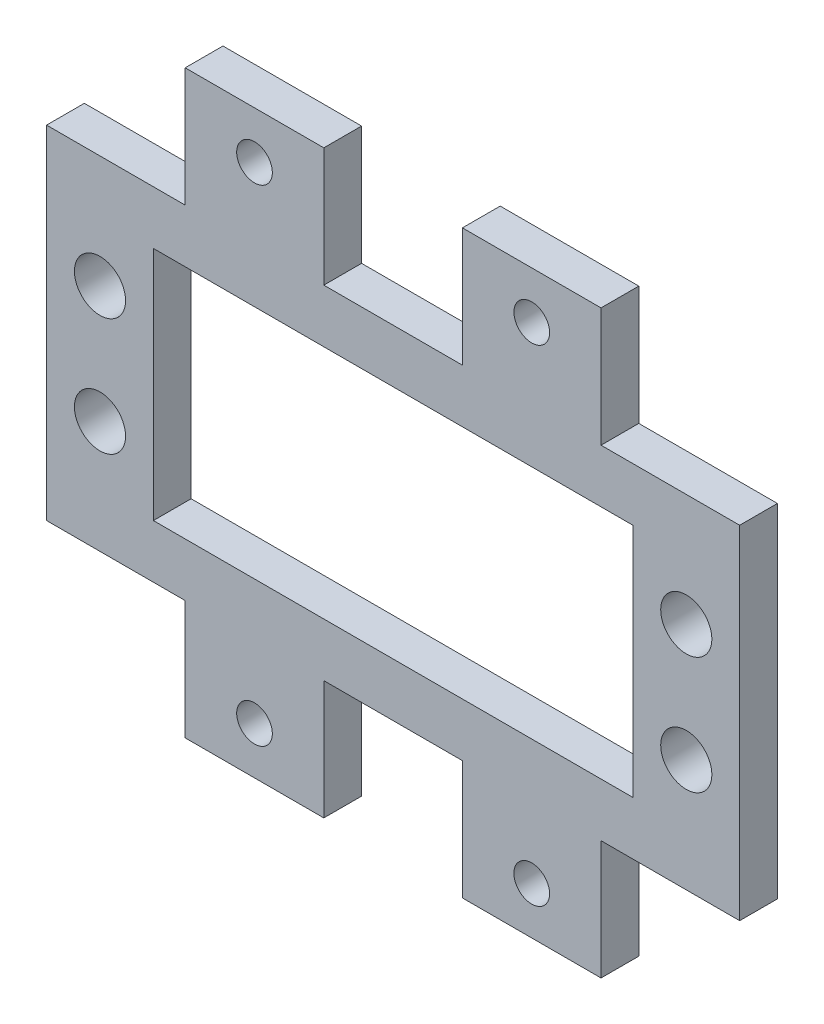
ISO-10303-21;
HEADER;
FILE_DESCRIPTION(('STEP AP214'),'2;1');
FILE_NAME('part.step','',(''),(''),'','','');
FILE_SCHEMA(('AUTOMOTIVE_DESIGN { 1 0 10303 214 1 1 1 1 }'));
ENDSEC;
DATA;
#1=APPLICATION_CONTEXT('core data for automotive mechanical design processes');
#2=APPLICATION_PROTOCOL_DEFINITION('international standard','automotive_design',2000,#1);
#3=PRODUCT_CONTEXT('',#1,'mechanical');
#4=PRODUCT('Part','Part','',(#3));
#5=PRODUCT_RELATED_PRODUCT_CATEGORY('part','',(#4));
#6=PRODUCT_DEFINITION_FORMATION('','',#4);
#7=PRODUCT_DEFINITION_CONTEXT('part definition',#1,'design');
#8=PRODUCT_DEFINITION('design','',#6,#7);
#9=PRODUCT_DEFINITION_SHAPE('','',#8);
#10=(LENGTH_UNIT() NAMED_UNIT(*) SI_UNIT(.MILLI.,.METRE.));
#11=(NAMED_UNIT(*) PLANE_ANGLE_UNIT() SI_UNIT($,.RADIAN.));
#12=(NAMED_UNIT(*) SI_UNIT($,.STERADIAN.) SOLID_ANGLE_UNIT());
#13=UNCERTAINTY_MEASURE_WITH_UNIT(LENGTH_MEASURE(1.E-05),#10,'distance_accuracy_value','');
#14=(GEOMETRIC_REPRESENTATION_CONTEXT(3) GLOBAL_UNCERTAINTY_ASSIGNED_CONTEXT((#13)) GLOBAL_UNIT_ASSIGNED_CONTEXT((#10,
#11,#12)) REPRESENTATION_CONTEXT('',''));
#15=CARTESIAN_POINT('',(0.,0.,0.));
#16=DIRECTION('',(0.,0.,1.));
#17=DIRECTION('',(1.,0.,0.));
#18=AXIS2_PLACEMENT_3D('',#15,#16,#17);
#19=CARTESIAN_POINT('',(0.,0.,3.175));
#20=DIRECTION('',(0.,0.,-1.));
#21=DIRECTION('',(-1.,0.,0.));
#22=AXIS2_PLACEMENT_3D('',#19,#20,#21);
#23=PLANE('',#22);
#24=DIRECTION('',(0.,1.,0.));
#25=VECTOR('',#24,1.);
#26=CARTESIAN_POINT('',(34.968,14.4,3.175));
#27=LINE('',#26,#25);
#28=CARTESIAN_POINT('',(34.968,14.4,3.175));
#29=VERTEX_POINT('',#28);
#30=CARTESIAN_POINT('',(34.968,24.4,3.175));
#31=VERTEX_POINT('',#30);
#32=EDGE_CURVE('E240',#29,#31,#27,.T.);
#33=ORIENTED_EDGE('',*,*,#32,.F.);
#34=DIRECTION('',(-1.,0.,0.));
#35=VECTOR('',#34,1.);
#36=CARTESIAN_POINT('',(23.312,14.4,3.175));
#37=LINE('',#36,#35);
#38=CARTESIAN_POINT('',(23.312,14.4,3.175));
#39=VERTEX_POINT('',#38);
#40=EDGE_CURVE('E234',#29,#39,#37,.T.);
#41=ORIENTED_EDGE('',*,*,#40,.T.);
#42=DIRECTION('',(0.,1.,0.));
#43=VECTOR('',#42,1.);
#44=CARTESIAN_POINT('',(23.312,14.4,3.175));
#45=LINE('',#44,#43);
#46=CARTESIAN_POINT('',(23.312,24.4,3.175));
#47=VERTEX_POINT('',#46);
#48=EDGE_CURVE('E114',#39,#47,#45,.T.);
#49=ORIENTED_EDGE('',*,*,#48,.T.);
#50=DIRECTION('',(-1.,0.,0.));
#51=VECTOR('',#50,1.);
#52=CARTESIAN_POINT('',(11.656,24.4,3.175));
#53=LINE('',#52,#51);
#54=CARTESIAN_POINT('',(11.656,24.4,3.175));
#55=VERTEX_POINT('',#54);
#56=EDGE_CURVE('E108',#47,#55,#53,.T.);
#57=ORIENTED_EDGE('',*,*,#56,.T.);
#58=DIRECTION('',(0.,-1.,0.));
#59=VECTOR('',#58,1.);
#60=CARTESIAN_POINT('',(11.656,14.4,3.175));
#61=LINE('',#60,#59);
#62=CARTESIAN_POINT('',(11.656,14.4,3.175));
#63=VERTEX_POINT('',#62);
#64=EDGE_CURVE('E112',#55,#63,#61,.T.);
#65=ORIENTED_EDGE('',*,*,#64,.T.);
#66=DIRECTION('',(-1.,0.,0.));
#67=VECTOR('',#66,1.);
#68=CARTESIAN_POINT('',(0.,14.4,3.175));
#69=LINE('',#68,#67);
#70=CARTESIAN_POINT('',(0.,14.4,3.175));
#71=VERTEX_POINT('',#70);
#72=EDGE_CURVE('E57',#63,#71,#69,.T.);
#73=ORIENTED_EDGE('',*,*,#72,.T.);
#74=DIRECTION('',(0.,-1.,0.));
#75=VECTOR('',#74,1.);
#76=CARTESIAN_POINT('',(0.,0.,3.175));
#77=LINE('',#76,#75);
#78=CARTESIAN_POINT('',(0.,-14.4,3.175));
#79=VERTEX_POINT('',#78);
#80=EDGE_CURVE('E132',#71,#79,#77,.T.);
#81=ORIENTED_EDGE('',*,*,#80,.T.);
#82=DIRECTION('',(-1.,0.,0.));
#83=VECTOR('',#82,1.);
#84=CARTESIAN_POINT('',(0.,-14.4,3.175));
#85=LINE('',#84,#83);
#86=CARTESIAN_POINT('',(11.656,-14.4,3.175));
#87=VERTEX_POINT('',#86);
#88=EDGE_CURVE('E204',#87,#79,#85,.T.);
#89=ORIENTED_EDGE('',*,*,#88,.F.);
#90=DIRECTION('',(0.,1.,0.));
#91=VECTOR('',#90,1.);
#92=CARTESIAN_POINT('',(11.656,-14.4,3.175));
#93=LINE('',#92,#91);
#94=CARTESIAN_POINT('',(11.656,-24.4,3.175));
#95=VERTEX_POINT('',#94);
#96=EDGE_CURVE('E282',#95,#87,#93,.T.);
#97=ORIENTED_EDGE('',*,*,#96,.F.);
#98=DIRECTION('',(-1.,0.,0.));
#99=VECTOR('',#98,1.);
#100=CARTESIAN_POINT('',(11.656,-24.4,3.175));
#101=LINE('',#100,#99);
#102=CARTESIAN_POINT('',(23.312,-24.4,3.175));
#103=VERTEX_POINT('',#102);
#104=EDGE_CURVE('E287',#103,#95,#101,.T.);
#105=ORIENTED_EDGE('',*,*,#104,.F.);
#106=DIRECTION('',(0.,-1.,0.));
#107=VECTOR('',#106,1.);
#108=CARTESIAN_POINT('',(23.312,-14.4,3.175));
#109=LINE('',#108,#107);
#110=CARTESIAN_POINT('',(23.312,-14.4,3.175));
#111=VERTEX_POINT('',#110);
#112=EDGE_CURVE('E291',#111,#103,#109,.T.);
#113=ORIENTED_EDGE('',*,*,#112,.F.);
#114=DIRECTION('',(-1.,0.,0.));
#115=VECTOR('',#114,1.);
#116=CARTESIAN_POINT('',(23.312,-14.4,3.175));
#117=LINE('',#116,#115);
#118=CARTESIAN_POINT('',(34.968,-14.4,3.175));
#119=VERTEX_POINT('',#118);
#120=EDGE_CURVE('E295',#119,#111,#117,.T.);
#121=ORIENTED_EDGE('',*,*,#120,.F.);
#122=DIRECTION('',(0.,-1.,0.));
#123=VECTOR('',#122,1.);
#124=CARTESIAN_POINT('',(34.968,-14.4,3.175));
#125=LINE('',#124,#123);
#126=CARTESIAN_POINT('',(34.968,-24.4,3.175));
#127=VERTEX_POINT('',#126);
#128=EDGE_CURVE('E547',#119,#127,#125,.T.);
#129=ORIENTED_EDGE('',*,*,#128,.T.);
#130=DIRECTION('',(1.,0.,0.));
#131=VECTOR('',#130,1.);
#132=CARTESIAN_POINT('',(46.624,-24.4,3.175));
#133=LINE('',#132,#131);
#134=CARTESIAN_POINT('',(46.624,-24.4,3.175));
#135=VERTEX_POINT('',#134);
#136=EDGE_CURVE('E565',#127,#135,#133,.T.);
#137=ORIENTED_EDGE('',*,*,#136,.T.);
#138=DIRECTION('',(0.,1.,0.));
#139=VECTOR('',#138,1.);
#140=CARTESIAN_POINT('',(46.624,-14.4,3.175));
#141=LINE('',#140,#139);
#142=CARTESIAN_POINT('',(46.624,-14.4,3.175));
#143=VERTEX_POINT('',#142);
#144=EDGE_CURVE('E452',#135,#143,#141,.T.);
#145=ORIENTED_EDGE('',*,*,#144,.T.);
#146=DIRECTION('',(1.,0.,0.));
#147=VECTOR('',#146,1.);
#148=CARTESIAN_POINT('',(58.28,-14.4,3.175));
#149=LINE('',#148,#147);
#150=CARTESIAN_POINT('',(58.28,-14.4,3.175));
#151=VERTEX_POINT('',#150);
#152=EDGE_CURVE('E435',#143,#151,#149,.T.);
#153=ORIENTED_EDGE('',*,*,#152,.T.);
#154=DIRECTION('',(0.,-1.,0.));
#155=VECTOR('',#154,1.);
#156=CARTESIAN_POINT('',(58.28,0.,3.175));
#157=LINE('',#156,#155);
#158=CARTESIAN_POINT('',(58.28,14.4,3.175));
#159=VERTEX_POINT('',#158);
#160=EDGE_CURVE('E449',#159,#151,#157,.T.);
#161=ORIENTED_EDGE('',*,*,#160,.F.);
#162=DIRECTION('',(1.,0.,0.));
#163=VECTOR('',#162,1.);
#164=CARTESIAN_POINT('',(58.28,14.4,3.175));
#165=LINE('',#164,#163);
#166=CARTESIAN_POINT('',(46.624,14.4,3.175));
#167=VERTEX_POINT('',#166);
#168=EDGE_CURVE('E460',#167,#159,#165,.T.);
#169=ORIENTED_EDGE('',*,*,#168,.F.);
#170=DIRECTION('',(0.,-1.,0.));
#171=VECTOR('',#170,1.);
#172=CARTESIAN_POINT('',(46.624,14.4,3.175));
#173=LINE('',#172,#171);
#174=CARTESIAN_POINT('',(46.624,24.4,3.175));
#175=VERTEX_POINT('',#174);
#176=EDGE_CURVE('E466',#175,#167,#173,.T.);
#177=ORIENTED_EDGE('',*,*,#176,.F.);
#178=DIRECTION('',(1.,0.,0.));
#179=VECTOR('',#178,1.);
#180=CARTESIAN_POINT('',(46.624,24.4,3.175));
#181=LINE('',#180,#179);
#182=EDGE_CURVE('E500',#31,#175,#181,.T.);
#183=ORIENTED_EDGE('',*,*,#182,.F.);
#184=EDGE_LOOP('',(#33,#41,#49,#57,#65,#73,#81,#89,#97,#105,#113,#121,#129,#137,#145,#153,#161,
#169,#177,#183));
#185=FACE_BOUND('',#184,.T.);
#186=DIRECTION('',(1.,0.,0.));
#187=VECTOR('',#186,1.);
#188=CARTESIAN_POINT('',(8.98,9.90999999999999,3.175));
#189=LINE('',#188,#187);
#190=CARTESIAN_POINT('',(8.98,9.90999999999999,3.175));
#191=VERTEX_POINT('',#190);
#192=CARTESIAN_POINT('',(49.3,9.90999999999999,3.175));
#193=VERTEX_POINT('',#192);
#194=EDGE_CURVE('E231',#191,#193,#189,.T.);
#195=ORIENTED_EDGE('',*,*,#194,.T.);
#196=DIRECTION('',(0.,1.,0.));
#197=VECTOR('',#196,1.);
#198=CARTESIAN_POINT('',(49.3,9.90999999999999,3.175));
#199=LINE('',#198,#197);
#200=CARTESIAN_POINT('',(49.3,-9.90999999999999,3.175));
#201=VERTEX_POINT('',#200);
#202=EDGE_CURVE('E491',#201,#193,#199,.T.);
#203=ORIENTED_EDGE('',*,*,#202,.F.);
#204=DIRECTION('',(1.,0.,0.));
#205=VECTOR('',#204,1.);
#206=CARTESIAN_POINT('',(8.98,-9.90999999999999,3.175));
#207=LINE('',#206,#205);
#208=CARTESIAN_POINT('',(8.98,-9.90999999999999,3.175));
#209=VERTEX_POINT('',#208);
#210=EDGE_CURVE('E299',#209,#201,#207,.T.);
#211=ORIENTED_EDGE('',*,*,#210,.F.);
#212=DIRECTION('',(0.,1.,0.));
#213=VECTOR('',#212,1.);
#214=CARTESIAN_POINT('',(8.98,9.90999999999999,3.175));
#215=LINE('',#214,#213);
#216=EDGE_CURVE('E96',#209,#191,#215,.T.);
#217=ORIENTED_EDGE('',*,*,#216,.T.);
#218=EDGE_LOOP('',(#195,#203,#211,#217));
#219=FACE_BOUND('',#218,.T.);
#220=CARTESIAN_POINT('',(17.484,20.43125,3.175));
#221=DIRECTION('',(0.,0.,1.));
#222=DIRECTION('',(1.,0.,0.));
#223=AXIS2_PLACEMENT_3D('',#220,#221,#222);
#224=CIRCLE('',#223,1.5);
#225=CARTESIAN_POINT('',(18.984,20.43125,3.175));
#226=VERTEX_POINT('',#225);
#227=EDGE_CURVE('E143',#226,#226,#224,.T.);
#228=ORIENTED_EDGE('',*,*,#227,.F.);
#229=EDGE_LOOP('',(#228));
#230=FACE_BOUND('',#229,.T.);
#231=CARTESIAN_POINT('',(4.49,4.935,3.175));
#232=DIRECTION('',(0.,0.,1.));
#233=DIRECTION('',(1.,0.,0.));
#234=AXIS2_PLACEMENT_3D('',#231,#232,#233);
#235=CIRCLE('',#234,2.15);
#236=CARTESIAN_POINT('',(6.64,4.935,3.175));
#237=VERTEX_POINT('',#236);
#238=EDGE_CURVE('E212',#237,#237,#235,.T.);
#239=ORIENTED_EDGE('',*,*,#238,.F.);
#240=EDGE_LOOP('',(#239));
#241=FACE_BOUND('',#240,.T.);
#242=CARTESIAN_POINT('',(4.49,-4.935,3.175));
#243=DIRECTION('',(0.,0.,-1.));
#244=DIRECTION('',(1.,0.,0.));
#245=AXIS2_PLACEMENT_3D('',#242,#243,#244);
#246=CIRCLE('',#245,2.15);
#247=CARTESIAN_POINT('',(6.64,-4.935,3.175));
#248=VERTEX_POINT('',#247);
#249=EDGE_CURVE('E265',#248,#248,#246,.T.);
#250=ORIENTED_EDGE('',*,*,#249,.T.);
#251=EDGE_LOOP('',(#250));
#252=FACE_BOUND('',#251,.T.);
#253=CARTESIAN_POINT('',(17.484,-20.43125,3.175));
#254=DIRECTION('',(0.,0.,-1.));
#255=DIRECTION('',(1.,0.,0.));
#256=AXIS2_PLACEMENT_3D('',#253,#254,#255);
#257=CIRCLE('',#256,1.5);
#258=CARTESIAN_POINT('',(18.984,-20.43125,3.175));
#259=VERTEX_POINT('',#258);
#260=EDGE_CURVE('E273',#259,#259,#257,.T.);
#261=ORIENTED_EDGE('',*,*,#260,.T.);
#262=EDGE_LOOP('',(#261));
#263=FACE_BOUND('',#262,.T.);
#264=CARTESIAN_POINT('',(40.796,20.43125,3.175));
#265=DIRECTION('',(0.,0.,-1.));
#266=DIRECTION('',(-1.,0.,0.));
#267=AXIS2_PLACEMENT_3D('',#264,#265,#266);
#268=CIRCLE('',#267,1.5);
#269=CARTESIAN_POINT('',(39.296,20.43125,3.175));
#270=VERTEX_POINT('',#269);
#271=EDGE_CURVE('E474',#270,#270,#268,.T.);
#272=ORIENTED_EDGE('',*,*,#271,.T.);
#273=EDGE_LOOP('',(#272));
#274=FACE_BOUND('',#273,.T.);
#275=CARTESIAN_POINT('',(53.79,4.935,3.175));
#276=DIRECTION('',(0.,0.,-1.));
#277=DIRECTION('',(-1.,0.,0.));
#278=AXIS2_PLACEMENT_3D('',#275,#276,#277);
#279=CIRCLE('',#278,2.15);
#280=CARTESIAN_POINT('',(51.64,4.935,3.175));
#281=VERTEX_POINT('',#280);
#282=EDGE_CURVE('E521',#281,#281,#279,.T.);
#283=ORIENTED_EDGE('',*,*,#282,.T.);
#284=EDGE_LOOP('',(#283));
#285=FACE_BOUND('',#284,.T.);
#286=CARTESIAN_POINT('',(53.79,-4.935,3.175));
#287=DIRECTION('',(0.,0.,1.));
#288=DIRECTION('',(-1.,0.,0.));
#289=AXIS2_PLACEMENT_3D('',#286,#287,#288);
#290=CIRCLE('',#289,2.15);
#291=CARTESIAN_POINT('',(51.64,-4.935,3.175));
#292=VERTEX_POINT('',#291);
#293=EDGE_CURVE('E574',#292,#292,#290,.T.);
#294=ORIENTED_EDGE('',*,*,#293,.F.);
#295=EDGE_LOOP('',(#294));
#296=FACE_BOUND('',#295,.T.);
#297=CARTESIAN_POINT('',(40.796,-20.43125,3.175));
#298=DIRECTION('',(0.,0.,1.));
#299=DIRECTION('',(-1.,0.,0.));
#300=AXIS2_PLACEMENT_3D('',#297,#298,#299);
#301=CIRCLE('',#300,1.5);
#302=CARTESIAN_POINT('',(39.296,-20.43125,3.175));
#303=VERTEX_POINT('',#302);
#304=EDGE_CURVE('E561',#303,#303,#301,.T.);
#305=ORIENTED_EDGE('',*,*,#304,.F.);
#306=EDGE_LOOP('',(#305));
#307=FACE_BOUND('',#306,.T.);
#308=ADVANCED_FACE('F39',(#185,#219,#230,#241,#252,#263,#274,#285,#296,#307),#23,.F.);
#309=CARTESIAN_POINT('',(0.,0.,0.));
#310=DIRECTION('',(0.,0.,-1.));
#311=DIRECTION('',(-1.,0.,0.));
#312=AXIS2_PLACEMENT_3D('',#309,#310,#311);
#313=PLANE('',#312);
#314=DIRECTION('',(-1.,0.,0.));
#315=VECTOR('',#314,1.);
#316=CARTESIAN_POINT('',(23.312,14.4,0.));
#317=LINE('',#316,#315);
#318=CARTESIAN_POINT('',(34.968,14.4,0.));
#319=VERTEX_POINT('',#318);
#320=CARTESIAN_POINT('',(23.312,14.4,0.));
#321=VERTEX_POINT('',#320);
#322=EDGE_CURVE('E147',#319,#321,#317,.T.);
#323=ORIENTED_EDGE('',*,*,#322,.F.);
#324=DIRECTION('',(0.,1.,0.));
#325=VECTOR('',#324,1.);
#326=CARTESIAN_POINT('',(34.968,14.4,0.));
#327=LINE('',#326,#325);
#328=CARTESIAN_POINT('',(34.968,24.4,0.));
#329=VERTEX_POINT('',#328);
#330=EDGE_CURVE('E251',#319,#329,#327,.T.);
#331=ORIENTED_EDGE('',*,*,#330,.T.);
#332=DIRECTION('',(1.,0.,0.));
#333=VECTOR('',#332,1.);
#334=CARTESIAN_POINT('',(46.624,24.4,0.));
#335=LINE('',#334,#333);
#336=CARTESIAN_POINT('',(46.624,24.4,0.));
#337=VERTEX_POINT('',#336);
#338=EDGE_CURVE('E477',#329,#337,#335,.T.);
#339=ORIENTED_EDGE('',*,*,#338,.T.);
#340=DIRECTION('',(0.,-1.,0.));
#341=VECTOR('',#340,1.);
#342=CARTESIAN_POINT('',(46.624,14.4,0.));
#343=LINE('',#342,#341);
#344=CARTESIAN_POINT('',(46.624,14.4,0.));
#345=VERTEX_POINT('',#344);
#346=EDGE_CURVE('E481',#337,#345,#343,.T.);
#347=ORIENTED_EDGE('',*,*,#346,.T.);
#348=DIRECTION('',(1.,0.,0.));
#349=VECTOR('',#348,1.);
#350=CARTESIAN_POINT('',(58.28,14.4,0.));
#351=LINE('',#350,#349);
#352=CARTESIAN_POINT('',(58.28,14.4,0.));
#353=VERTEX_POINT('',#352);
#354=EDGE_CURVE('E485',#345,#353,#351,.T.);
#355=ORIENTED_EDGE('',*,*,#354,.T.);
#356=DIRECTION('',(0.,-1.,0.));
#357=VECTOR('',#356,1.);
#358=CARTESIAN_POINT('',(58.28,0.,0.));
#359=LINE('',#358,#357);
#360=CARTESIAN_POINT('',(58.28,-14.4,0.));
#361=VERTEX_POINT('',#360);
#362=EDGE_CURVE('E489',#353,#361,#359,.T.);
#363=ORIENTED_EDGE('',*,*,#362,.T.);
#364=DIRECTION('',(1.,0.,0.));
#365=VECTOR('',#364,1.);
#366=CARTESIAN_POINT('',(58.28,-14.4,0.));
#367=LINE('',#366,#365);
#368=CARTESIAN_POINT('',(46.624,-14.4,0.));
#369=VERTEX_POINT('',#368);
#370=EDGE_CURVE('E438',#369,#361,#367,.T.);
#371=ORIENTED_EDGE('',*,*,#370,.F.);
#372=DIRECTION('',(0.,1.,0.));
#373=VECTOR('',#372,1.);
#374=CARTESIAN_POINT('',(46.624,-14.4,0.));
#375=LINE('',#374,#373);
#376=CARTESIAN_POINT('',(46.624,-24.4,0.));
#377=VERTEX_POINT('',#376);
#378=EDGE_CURVE('E555',#377,#369,#375,.T.);
#379=ORIENTED_EDGE('',*,*,#378,.F.);
#380=DIRECTION('',(1.,0.,0.));
#381=VECTOR('',#380,1.);
#382=CARTESIAN_POINT('',(46.624,-24.4,0.));
#383=LINE('',#382,#381);
#384=CARTESIAN_POINT('',(34.968,-24.4,0.));
#385=VERTEX_POINT('',#384);
#386=EDGE_CURVE('E551',#385,#377,#383,.T.);
#387=ORIENTED_EDGE('',*,*,#386,.F.);
#388=DIRECTION('',(0.,-1.,0.));
#389=VECTOR('',#388,1.);
#390=CARTESIAN_POINT('',(34.968,-14.4,0.));
#391=LINE('',#390,#389);
#392=CARTESIAN_POINT('',(34.968,-14.4,0.));
#393=VERTEX_POINT('',#392);
#394=EDGE_CURVE('E454',#393,#385,#391,.T.);
#395=ORIENTED_EDGE('',*,*,#394,.F.);
#396=DIRECTION('',(-1.,0.,0.));
#397=VECTOR('',#396,1.);
#398=CARTESIAN_POINT('',(23.312,-14.4,0.));
#399=LINE('',#398,#397);
#400=CARTESIAN_POINT('',(23.312,-14.4,0.));
#401=VERTEX_POINT('',#400);
#402=EDGE_CURVE('E317',#393,#401,#399,.T.);
#403=ORIENTED_EDGE('',*,*,#402,.T.);
#404=DIRECTION('',(0.,-1.,0.));
#405=VECTOR('',#404,1.);
#406=CARTESIAN_POINT('',(23.312,-14.4,0.));
#407=LINE('',#406,#405);
#408=CARTESIAN_POINT('',(23.312,-24.4,0.));
#409=VERTEX_POINT('',#408);
#410=EDGE_CURVE('E313',#401,#409,#407,.T.);
#411=ORIENTED_EDGE('',*,*,#410,.T.);
#412=DIRECTION('',(-1.,0.,0.));
#413=VECTOR('',#412,1.);
#414=CARTESIAN_POINT('',(11.656,-24.4,0.));
#415=LINE('',#414,#413);
#416=CARTESIAN_POINT('',(11.656,-24.4,0.));
#417=VERTEX_POINT('',#416);
#418=EDGE_CURVE('E309',#409,#417,#415,.T.);
#419=ORIENTED_EDGE('',*,*,#418,.T.);
#420=DIRECTION('',(0.,1.,0.));
#421=VECTOR('',#420,1.);
#422=CARTESIAN_POINT('',(11.656,-14.4,0.));
#423=LINE('',#422,#421);
#424=CARTESIAN_POINT('',(11.656,-14.4,0.));
#425=VERTEX_POINT('',#424);
#426=EDGE_CURVE('E306',#417,#425,#423,.T.);
#427=ORIENTED_EDGE('',*,*,#426,.T.);
#428=DIRECTION('',(-1.,0.,0.));
#429=VECTOR('',#428,1.);
#430=CARTESIAN_POINT('',(0.,-14.4,0.));
#431=LINE('',#430,#429);
#432=CARTESIAN_POINT('',(0.,-14.4,0.));
#433=VERTEX_POINT('',#432);
#434=EDGE_CURVE('E188',#425,#433,#431,.T.);
#435=ORIENTED_EDGE('',*,*,#434,.T.);
#436=DIRECTION('',(0.,-1.,0.));
#437=VECTOR('',#436,1.);
#438=CARTESIAN_POINT('',(0.,0.,0.));
#439=LINE('',#438,#437);
#440=CARTESIAN_POINT('',(0.,14.4,0.));
#441=VERTEX_POINT('',#440);
#442=EDGE_CURVE('E159',#441,#433,#439,.T.);
#443=ORIENTED_EDGE('',*,*,#442,.F.);
#444=DIRECTION('',(-1.,0.,0.));
#445=VECTOR('',#444,1.);
#446=CARTESIAN_POINT('',(0.,14.4,0.));
#447=LINE('',#446,#445);
#448=CARTESIAN_POINT('',(11.656,14.4,0.));
#449=VERTEX_POINT('',#448);
#450=EDGE_CURVE('E87',#449,#441,#447,.T.);
#451=ORIENTED_EDGE('',*,*,#450,.F.);
#452=DIRECTION('',(0.,-1.,0.));
#453=VECTOR('',#452,1.);
#454=CARTESIAN_POINT('',(11.656,14.4,0.));
#455=LINE('',#454,#453);
#456=CARTESIAN_POINT('',(11.656,24.4,0.));
#457=VERTEX_POINT('',#456);
#458=EDGE_CURVE('E81',#457,#449,#455,.T.);
#459=ORIENTED_EDGE('',*,*,#458,.F.);
#460=DIRECTION('',(-1.,0.,0.));
#461=VECTOR('',#460,1.);
#462=CARTESIAN_POINT('',(11.656,24.4,0.));
#463=LINE('',#462,#461);
#464=CARTESIAN_POINT('',(23.312,24.4,0.));
#465=VERTEX_POINT('',#464);
#466=EDGE_CURVE('E123',#465,#457,#463,.T.);
#467=ORIENTED_EDGE('',*,*,#466,.F.);
#468=DIRECTION('',(0.,1.,0.));
#469=VECTOR('',#468,1.);
#470=CARTESIAN_POINT('',(23.312,14.4,0.));
#471=LINE('',#470,#469);
#472=EDGE_CURVE('E150',#321,#465,#471,.T.);
#473=ORIENTED_EDGE('',*,*,#472,.F.);
#474=EDGE_LOOP('',(#323,#331,#339,#347,#355,#363,#371,#379,#387,#395,#403,#411,#419,#427,#435,
#443,#451,#459,#467,#473));
#475=FACE_BOUND('',#474,.T.);
#476=CARTESIAN_POINT('',(17.484,20.43125,0.));
#477=DIRECTION('',(0.,0.,1.));
#478=DIRECTION('',(1.,0.,0.));
#479=AXIS2_PLACEMENT_3D('',#476,#477,#478);
#480=CIRCLE('',#479,1.5);
#481=CARTESIAN_POINT('',(18.984,20.43125,0.));
#482=VERTEX_POINT('',#481);
#483=EDGE_CURVE('E221',#482,#482,#480,.T.);
#484=ORIENTED_EDGE('',*,*,#483,.T.);
#485=EDGE_LOOP('',(#484));
#486=FACE_BOUND('',#485,.T.);
#487=DIRECTION('',(0.,1.,0.));
#488=VECTOR('',#487,1.);
#489=CARTESIAN_POINT('',(8.98,9.90999999999999,0.));
#490=LINE('',#489,#488);
#491=CARTESIAN_POINT('',(8.98,-9.90999999999999,0.));
#492=VERTEX_POINT('',#491);
#493=CARTESIAN_POINT('',(8.98,9.90999999999999,0.));
#494=VERTEX_POINT('',#493);
#495=EDGE_CURVE('E139',#492,#494,#490,.T.);
#496=ORIENTED_EDGE('',*,*,#495,.F.);
#497=DIRECTION('',(1.,0.,0.));
#498=VECTOR('',#497,1.);
#499=CARTESIAN_POINT('',(8.98,-9.90999999999999,0.));
#500=LINE('',#499,#498);
#501=CARTESIAN_POINT('',(49.3,-9.90999999999999,0.));
#502=VERTEX_POINT('',#501);
#503=EDGE_CURVE('E283',#492,#502,#500,.T.);
#504=ORIENTED_EDGE('',*,*,#503,.T.);
#505=DIRECTION('',(0.,1.,0.));
#506=VECTOR('',#505,1.);
#507=CARTESIAN_POINT('',(49.3,9.90999999999999,0.));
#508=LINE('',#507,#506);
#509=CARTESIAN_POINT('',(49.3,9.90999999999999,0.));
#510=VERTEX_POINT('',#509);
#511=EDGE_CURVE('E470',#502,#510,#508,.T.);
#512=ORIENTED_EDGE('',*,*,#511,.T.);
#513=DIRECTION('',(1.,0.,0.));
#514=VECTOR('',#513,1.);
#515=CARTESIAN_POINT('',(8.98,9.90999999999999,0.));
#516=LINE('',#515,#514);
#517=EDGE_CURVE('E142',#494,#510,#516,.T.);
#518=ORIENTED_EDGE('',*,*,#517,.F.);
#519=EDGE_LOOP('',(#496,#504,#512,#518));
#520=FACE_BOUND('',#519,.T.);
#521=CARTESIAN_POINT('',(4.49,4.935,0.));
#522=DIRECTION('',(0.,0.,1.));
#523=DIRECTION('',(1.,0.,0.));
#524=AXIS2_PLACEMENT_3D('',#521,#522,#523);
#525=CIRCLE('',#524,2.15);
#526=CARTESIAN_POINT('',(6.64,4.935,0.));
#527=VERTEX_POINT('',#526);
#528=EDGE_CURVE('E206',#527,#527,#525,.T.);
#529=ORIENTED_EDGE('',*,*,#528,.T.);
#530=EDGE_LOOP('',(#529));
#531=FACE_BOUND('',#530,.T.);
#532=CARTESIAN_POINT('',(4.49,-4.935,0.));
#533=DIRECTION('',(0.,0.,-1.));
#534=DIRECTION('',(1.,0.,0.));
#535=AXIS2_PLACEMENT_3D('',#532,#533,#534);
#536=CIRCLE('',#535,2.15);
#537=CARTESIAN_POINT('',(6.64,-4.935,0.));
#538=VERTEX_POINT('',#537);
#539=EDGE_CURVE('E259',#538,#538,#536,.T.);
#540=ORIENTED_EDGE('',*,*,#539,.F.);
#541=EDGE_LOOP('',(#540));
#542=FACE_BOUND('',#541,.T.);
#543=CARTESIAN_POINT('',(17.484,-20.43125,0.));
#544=DIRECTION('',(0.,0.,-1.));
#545=DIRECTION('',(1.,0.,0.));
#546=AXIS2_PLACEMENT_3D('',#543,#544,#545);
#547=CIRCLE('',#546,1.5);
#548=CARTESIAN_POINT('',(18.984,-20.43125,0.));
#549=VERTEX_POINT('',#548);
#550=EDGE_CURVE('E269',#549,#549,#547,.T.);
#551=ORIENTED_EDGE('',*,*,#550,.F.);
#552=EDGE_LOOP('',(#551));
#553=FACE_BOUND('',#552,.T.);
#554=CARTESIAN_POINT('',(40.796,20.43125,0.));
#555=DIRECTION('',(0.,0.,-1.));
#556=DIRECTION('',(-1.,0.,0.));
#557=AXIS2_PLACEMENT_3D('',#554,#555,#556);
#558=CIRCLE('',#557,1.5);
#559=CARTESIAN_POINT('',(39.296,20.43125,0.));
#560=VERTEX_POINT('',#559);
#561=EDGE_CURVE('E517',#560,#560,#558,.T.);
#562=ORIENTED_EDGE('',*,*,#561,.F.);
#563=EDGE_LOOP('',(#562));
#564=FACE_BOUND('',#563,.T.);
#565=CARTESIAN_POINT('',(53.79,4.935,0.));
#566=DIRECTION('',(0.,0.,-1.));
#567=DIRECTION('',(-1.,0.,0.));
#568=AXIS2_PLACEMENT_3D('',#565,#566,#567);
#569=CIRCLE('',#568,2.15);
#570=CARTESIAN_POINT('',(51.64,4.935,0.));
#571=VERTEX_POINT('',#570);
#572=EDGE_CURVE('E444',#571,#571,#569,.T.);
#573=ORIENTED_EDGE('',*,*,#572,.F.);
#574=EDGE_LOOP('',(#573));
#575=FACE_BOUND('',#574,.T.);
#576=CARTESIAN_POINT('',(53.79,-4.935,0.));
#577=DIRECTION('',(0.,0.,1.));
#578=DIRECTION('',(-1.,0.,0.));
#579=AXIS2_PLACEMENT_3D('',#576,#577,#578);
#580=CIRCLE('',#579,2.15);
#581=CARTESIAN_POINT('',(51.64,-4.935,0.));
#582=VERTEX_POINT('',#581);
#583=EDGE_CURVE('E578',#582,#582,#580,.T.);
#584=ORIENTED_EDGE('',*,*,#583,.T.);
#585=EDGE_LOOP('',(#584));
#586=FACE_BOUND('',#585,.T.);
#587=CARTESIAN_POINT('',(40.796,-20.43125,0.));
#588=DIRECTION('',(0.,0.,1.));
#589=DIRECTION('',(-1.,0.,0.));
#590=AXIS2_PLACEMENT_3D('',#587,#588,#589);
#591=CIRCLE('',#590,1.5);
#592=CARTESIAN_POINT('',(39.296,-20.43125,0.));
#593=VERTEX_POINT('',#592);
#594=EDGE_CURVE('E570',#593,#593,#591,.T.);
#595=ORIENTED_EDGE('',*,*,#594,.T.);
#596=EDGE_LOOP('',(#595));
#597=FACE_BOUND('',#596,.T.);
#598=ADVANCED_FACE('F178',(#475,#486,#520,#531,#542,#553,#564,#575,#586,#597),#313,.T.);
#599=CARTESIAN_POINT('',(8.98,9.90999999999999,3.175));
#600=DIRECTION('',(-1.,0.,0.));
#601=DIRECTION('',(0.,0.,1.));
#602=AXIS2_PLACEMENT_3D('',#599,#600,#601);
#603=PLANE('',#602);
#604=ORIENTED_EDGE('',*,*,#495,.T.);
#605=DIRECTION('',(0.,0.,-1.));
#606=VECTOR('',#605,1.);
#607=CARTESIAN_POINT('',(8.98,9.90999999999999,3.175));
#608=LINE('',#607,#606);
#609=EDGE_CURVE('E11',#191,#494,#608,.T.);
#610=ORIENTED_EDGE('',*,*,#609,.F.);
#611=ORIENTED_EDGE('',*,*,#216,.F.);
#612=DIRECTION('',(0.,0.,-1.));
#613=VECTOR('',#612,1.);
#614=CARTESIAN_POINT('',(8.98,-9.90999999999999,3.175));
#615=LINE('',#614,#613);
#616=EDGE_CURVE('E303',#209,#492,#615,.T.);
#617=ORIENTED_EDGE('',*,*,#616,.T.);
#618=EDGE_LOOP('',(#604,#610,#611,#617));
#619=FACE_BOUND('',#618,.T.);
#620=ADVANCED_FACE('F41',(#619),#603,.F.);
#621=CARTESIAN_POINT('',(8.98,9.90999999999999,3.175));
#622=DIRECTION('',(0.,1.,0.));
#623=DIRECTION('',(-1.,0.,0.));
#624=AXIS2_PLACEMENT_3D('',#621,#622,#623);
#625=PLANE('',#624);
#626=ORIENTED_EDGE('',*,*,#517,.T.);
#627=DIRECTION('',(0.,0.,-1.));
#628=VECTOR('',#627,1.);
#629=CARTESIAN_POINT('',(49.3,9.90999999999999,3.175));
#630=LINE('',#629,#628);
#631=EDGE_CURVE('E253',#193,#510,#630,.T.);
#632=ORIENTED_EDGE('',*,*,#631,.F.);
#633=ORIENTED_EDGE('',*,*,#194,.F.);
#634=ORIENTED_EDGE('',*,*,#609,.T.);
#635=EDGE_LOOP('',(#626,#632,#633,#634));
#636=FACE_BOUND('',#635,.T.);
#637=ADVANCED_FACE('F606',(#636),#625,.F.);
#638=CARTESIAN_POINT('',(23.312,14.4,3.175));
#639=DIRECTION('',(0.,-1.,0.));
#640=DIRECTION('',(0.,0.,-1.));
#641=AXIS2_PLACEMENT_3D('',#638,#639,#640);
#642=PLANE('',#641);
#643=ORIENTED_EDGE('',*,*,#322,.T.);
#644=DIRECTION('',(0.,0.,-1.));
#645=VECTOR('',#644,1.);
#646=CARTESIAN_POINT('',(23.312,14.4,3.175));
#647=LINE('',#646,#645);
#648=EDGE_CURVE('E49',#39,#321,#647,.T.);
#649=ORIENTED_EDGE('',*,*,#648,.F.);
#650=ORIENTED_EDGE('',*,*,#40,.F.);
#651=DIRECTION('',(0.,0.,-1.));
#652=VECTOR('',#651,1.);
#653=CARTESIAN_POINT('',(34.968,14.4,3.175));
#654=LINE('',#653,#652);
#655=EDGE_CURVE('E243',#29,#319,#654,.T.);
#656=ORIENTED_EDGE('',*,*,#655,.T.);
#657=EDGE_LOOP('',(#643,#649,#650,#656));
#658=FACE_BOUND('',#657,.T.);
#659=ADVANCED_FACE('F242',(#658),#642,.F.);
#660=CARTESIAN_POINT('',(23.312,14.4,3.175));
#661=DIRECTION('',(-1.,0.,0.));
#662=DIRECTION('',(0.,0.,1.));
#663=AXIS2_PLACEMENT_3D('',#660,#661,#662);
#664=PLANE('',#663);
#665=ORIENTED_EDGE('',*,*,#472,.T.);
#666=DIRECTION('',(0.,0.,-1.));
#667=VECTOR('',#666,1.);
#668=CARTESIAN_POINT('',(23.312,24.4,3.175));
#669=LINE('',#668,#667);
#670=EDGE_CURVE('E125',#47,#465,#669,.T.);
#671=ORIENTED_EDGE('',*,*,#670,.F.);
#672=ORIENTED_EDGE('',*,*,#48,.F.);
#673=ORIENTED_EDGE('',*,*,#648,.T.);
#674=EDGE_LOOP('',(#665,#671,#672,#673));
#675=FACE_BOUND('',#674,.T.);
#676=ADVANCED_FACE('F173',(#675),#664,.F.);
#677=CARTESIAN_POINT('',(11.656,24.4,3.175));
#678=DIRECTION('',(0.,-1.,0.));
#679=DIRECTION('',(0.,0.,-1.));
#680=AXIS2_PLACEMENT_3D('',#677,#678,#679);
#681=PLANE('',#680);
#682=ORIENTED_EDGE('',*,*,#466,.T.);
#683=DIRECTION('',(0.,0.,-1.));
#684=VECTOR('',#683,1.);
#685=CARTESIAN_POINT('',(11.656,24.4,3.175));
#686=LINE('',#685,#684);
#687=EDGE_CURVE('E120',#55,#457,#686,.T.);
#688=ORIENTED_EDGE('',*,*,#687,.F.);
#689=ORIENTED_EDGE('',*,*,#56,.F.);
#690=ORIENTED_EDGE('',*,*,#670,.T.);
#691=EDGE_LOOP('',(#682,#688,#689,#690));
#692=FACE_BOUND('',#691,.T.);
#693=ADVANCED_FACE('F121',(#692),#681,.F.);
#694=CARTESIAN_POINT('',(11.656,14.4,3.175));
#695=DIRECTION('',(1.,0.,0.));
#696=DIRECTION('',(0.,0.,-1.));
#697=AXIS2_PLACEMENT_3D('',#694,#695,#696);
#698=PLANE('',#697);
#699=ORIENTED_EDGE('',*,*,#458,.T.);
#700=DIRECTION('',(0.,0.,-1.));
#701=VECTOR('',#700,1.);
#702=CARTESIAN_POINT('',(11.656,14.4,3.175));
#703=LINE('',#702,#701);
#704=EDGE_CURVE('E126',#63,#449,#703,.T.);
#705=ORIENTED_EDGE('',*,*,#704,.F.);
#706=ORIENTED_EDGE('',*,*,#64,.F.);
#707=ORIENTED_EDGE('',*,*,#687,.T.);
#708=EDGE_LOOP('',(#699,#705,#706,#707));
#709=FACE_BOUND('',#708,.T.);
#710=ADVANCED_FACE('F128',(#709),#698,.F.);
#711=CARTESIAN_POINT('',(0.,14.4,3.175));
#712=DIRECTION('',(0.,-1.,0.));
#713=DIRECTION('',(1.,0.,0.));
#714=AXIS2_PLACEMENT_3D('',#711,#712,#713);
#715=PLANE('',#714);
#716=ORIENTED_EDGE('',*,*,#450,.T.);
#717=DIRECTION('',(0.,0.,-1.));
#718=VECTOR('',#717,1.);
#719=CARTESIAN_POINT('',(0.,14.4,3.175));
#720=LINE('',#719,#718);
#721=EDGE_CURVE('E138',#71,#441,#720,.T.);
#722=ORIENTED_EDGE('',*,*,#721,.F.);
#723=ORIENTED_EDGE('',*,*,#72,.F.);
#724=ORIENTED_EDGE('',*,*,#704,.T.);
#725=EDGE_LOOP('',(#716,#722,#723,#724));
#726=FACE_BOUND('',#725,.T.);
#727=ADVANCED_FACE('F613',(#726),#715,.F.);
#728=CARTESIAN_POINT('',(0.,0.,3.175));
#729=DIRECTION('',(1.,0.,0.));
#730=DIRECTION('',(0.,0.,-1.));
#731=AXIS2_PLACEMENT_3D('',#728,#729,#730);
#732=PLANE('',#731);
#733=ORIENTED_EDGE('',*,*,#442,.T.);
#734=DIRECTION('',(0.,0.,-1.));
#735=VECTOR('',#734,1.);
#736=CARTESIAN_POINT('',(0.,-14.4,3.175));
#737=LINE('',#736,#735);
#738=EDGE_CURVE('E195',#79,#433,#737,.T.);
#739=ORIENTED_EDGE('',*,*,#738,.F.);
#740=ORIENTED_EDGE('',*,*,#80,.F.);
#741=ORIENTED_EDGE('',*,*,#721,.T.);
#742=EDGE_LOOP('',(#733,#739,#740,#741));
#743=FACE_BOUND('',#742,.T.);
#744=ADVANCED_FACE('F192',(#743),#732,.F.);
#745=CARTESIAN_POINT('',(17.484,20.43125,3.175));
#746=DIRECTION('',(0.,0.,-1.));
#747=DIRECTION('',(-1.,0.,0.));
#748=AXIS2_PLACEMENT_3D('',#745,#746,#747);
#749=CYLINDRICAL_SURFACE('',#748,1.5);
#750=ORIENTED_EDGE('',*,*,#227,.T.);
#751=EDGE_LOOP('',(#750));
#752=FACE_BOUND('',#751,.T.);
#753=ORIENTED_EDGE('',*,*,#483,.F.);
#754=EDGE_LOOP('',(#753));
#755=FACE_BOUND('',#754,.T.);
#756=ADVANCED_FACE('F612',(#752,#755),#749,.F.);
#757=CARTESIAN_POINT('',(4.49,4.935,3.175));
#758=DIRECTION('',(0.,0.,-1.));
#759=DIRECTION('',(-1.,0.,0.));
#760=AXIS2_PLACEMENT_3D('',#757,#758,#759);
#761=CYLINDRICAL_SURFACE('',#760,2.15);
#762=ORIENTED_EDGE('',*,*,#238,.T.);
#763=EDGE_LOOP('',(#762));
#764=FACE_BOUND('',#763,.T.);
#765=ORIENTED_EDGE('',*,*,#528,.F.);
#766=EDGE_LOOP('',(#765));
#767=FACE_BOUND('',#766,.T.);
#768=ADVANCED_FACE('F717',(#764,#767),#761,.F.);
#769=CARTESIAN_POINT('',(0.,-14.4,3.175));
#770=DIRECTION('',(0.,-1.,0.));
#771=DIRECTION('',(1.,0.,0.));
#772=AXIS2_PLACEMENT_3D('',#769,#770,#771);
#773=PLANE('',#772);
#774=ORIENTED_EDGE('',*,*,#434,.F.);
#775=DIRECTION('',(0.,0.,-1.));
#776=VECTOR('',#775,1.);
#777=CARTESIAN_POINT('',(11.656,-14.4,3.175));
#778=LINE('',#777,#776);
#779=EDGE_CURVE('E207',#87,#425,#778,.T.);
#780=ORIENTED_EDGE('',*,*,#779,.F.);
#781=ORIENTED_EDGE('',*,*,#88,.T.);
#782=ORIENTED_EDGE('',*,*,#738,.T.);
#783=EDGE_LOOP('',(#774,#780,#781,#782));
#784=FACE_BOUND('',#783,.T.);
#785=ADVANCED_FACE('F201',(#784),#773,.T.);
#786=CARTESIAN_POINT('',(11.656,-14.4,3.175));
#787=DIRECTION('',(-1.,0.,0.));
#788=DIRECTION('',(0.,0.,1.));
#789=AXIS2_PLACEMENT_3D('',#786,#787,#788);
#790=PLANE('',#789);
#791=ORIENTED_EDGE('',*,*,#426,.F.);
#792=DIRECTION('',(0.,0.,-1.));
#793=VECTOR('',#792,1.);
#794=CARTESIAN_POINT('',(11.656,-24.4,3.175));
#795=LINE('',#794,#793);
#796=EDGE_CURVE('E215',#95,#417,#795,.T.);
#797=ORIENTED_EDGE('',*,*,#796,.F.);
#798=ORIENTED_EDGE('',*,*,#96,.T.);
#799=ORIENTED_EDGE('',*,*,#779,.T.);
#800=EDGE_LOOP('',(#791,#797,#798,#799));
#801=FACE_BOUND('',#800,.T.);
#802=ADVANCED_FACE('F349',(#801),#790,.T.);
#803=CARTESIAN_POINT('',(11.656,-24.4,3.175));
#804=DIRECTION('',(0.,-1.,0.));
#805=DIRECTION('',(0.,0.,-1.));
#806=AXIS2_PLACEMENT_3D('',#803,#804,#805);
#807=PLANE('',#806);
#808=ORIENTED_EDGE('',*,*,#418,.F.);
#809=DIRECTION('',(0.,0.,-1.));
#810=VECTOR('',#809,1.);
#811=CARTESIAN_POINT('',(23.312,-24.4,3.175));
#812=LINE('',#811,#810);
#813=EDGE_CURVE('E331',#103,#409,#812,.T.);
#814=ORIENTED_EDGE('',*,*,#813,.F.);
#815=ORIENTED_EDGE('',*,*,#104,.T.);
#816=ORIENTED_EDGE('',*,*,#796,.T.);
#817=EDGE_LOOP('',(#808,#814,#815,#816));
#818=FACE_BOUND('',#817,.T.);
#819=ADVANCED_FACE('F341',(#818),#807,.T.);
#820=CARTESIAN_POINT('',(23.312,-14.4,3.175));
#821=DIRECTION('',(1.,0.,0.));
#822=DIRECTION('',(0.,0.,-1.));
#823=AXIS2_PLACEMENT_3D('',#820,#821,#822);
#824=PLANE('',#823);
#825=ORIENTED_EDGE('',*,*,#410,.F.);
#826=DIRECTION('',(0.,0.,-1.));
#827=VECTOR('',#826,1.);
#828=CARTESIAN_POINT('',(23.312,-14.4,3.175));
#829=LINE('',#828,#827);
#830=EDGE_CURVE('E327',#111,#401,#829,.T.);
#831=ORIENTED_EDGE('',*,*,#830,.F.);
#832=ORIENTED_EDGE('',*,*,#112,.T.);
#833=ORIENTED_EDGE('',*,*,#813,.T.);
#834=EDGE_LOOP('',(#825,#831,#832,#833));
#835=FACE_BOUND('',#834,.T.);
#836=ADVANCED_FACE('F357',(#835),#824,.T.);
#837=CARTESIAN_POINT('',(23.312,-14.4,3.175));
#838=DIRECTION('',(0.,-1.,0.));
#839=DIRECTION('',(0.,0.,-1.));
#840=AXIS2_PLACEMENT_3D('',#837,#838,#839);
#841=PLANE('',#840);
#842=ORIENTED_EDGE('',*,*,#402,.F.);
#843=DIRECTION('',(0.,0.,-1.));
#844=VECTOR('',#843,1.);
#845=CARTESIAN_POINT('',(34.968,-14.4,3.175));
#846=LINE('',#845,#844);
#847=EDGE_CURVE('E539',#119,#393,#846,.T.);
#848=ORIENTED_EDGE('',*,*,#847,.F.);
#849=ORIENTED_EDGE('',*,*,#120,.T.);
#850=ORIENTED_EDGE('',*,*,#830,.T.);
#851=EDGE_LOOP('',(#842,#848,#849,#850));
#852=FACE_BOUND('',#851,.T.);
#853=ADVANCED_FACE('F706',(#852),#841,.T.);
#854=CARTESIAN_POINT('',(8.98,-9.90999999999999,3.175));
#855=DIRECTION('',(0.,1.,0.));
#856=DIRECTION('',(-1.,0.,0.));
#857=AXIS2_PLACEMENT_3D('',#854,#855,#856);
#858=PLANE('',#857);
#859=ORIENTED_EDGE('',*,*,#503,.F.);
#860=ORIENTED_EDGE('',*,*,#616,.F.);
#861=ORIENTED_EDGE('',*,*,#210,.T.);
#862=DIRECTION('',(0.,0.,-1.));
#863=VECTOR('',#862,1.);
#864=CARTESIAN_POINT('',(49.3,-9.90999999999999,3.175));
#865=LINE('',#864,#863);
#866=EDGE_CURVE('E543',#201,#502,#865,.T.);
#867=ORIENTED_EDGE('',*,*,#866,.T.);
#868=EDGE_LOOP('',(#859,#860,#861,#867));
#869=FACE_BOUND('',#868,.T.);
#870=ADVANCED_FACE('F640',(#869),#858,.T.);
#871=CARTESIAN_POINT('',(17.484,-20.43125,3.175));
#872=DIRECTION('',(0.,0.,-1.));
#873=DIRECTION('',(-1.,0.,0.));
#874=AXIS2_PLACEMENT_3D('',#871,#872,#873);
#875=CYLINDRICAL_SURFACE('',#874,1.5);
#876=ORIENTED_EDGE('',*,*,#260,.F.);
#877=EDGE_LOOP('',(#876));
#878=FACE_BOUND('',#877,.T.);
#879=ORIENTED_EDGE('',*,*,#550,.T.);
#880=EDGE_LOOP('',(#879));
#881=FACE_BOUND('',#880,.T.);
#882=ADVANCED_FACE('F699',(#878,#881),#875,.F.);
#883=CARTESIAN_POINT('',(4.49,-4.935,3.175));
#884=DIRECTION('',(0.,0.,-1.));
#885=DIRECTION('',(-1.,0.,0.));
#886=AXIS2_PLACEMENT_3D('',#883,#884,#885);
#887=CYLINDRICAL_SURFACE('',#886,2.15);
#888=ORIENTED_EDGE('',*,*,#249,.F.);
#889=EDGE_LOOP('',(#888));
#890=FACE_BOUND('',#889,.T.);
#891=ORIENTED_EDGE('',*,*,#539,.T.);
#892=EDGE_LOOP('',(#891));
#893=FACE_BOUND('',#892,.T.);
#894=ADVANCED_FACE('F696',(#890,#893),#887,.F.);
#895=CARTESIAN_POINT('',(49.3,9.90999999999999,3.175));
#896=DIRECTION('',(1.,0.,0.));
#897=DIRECTION('',(0.,0.,1.));
#898=AXIS2_PLACEMENT_3D('',#895,#896,#897);
#899=PLANE('',#898);
#900=ORIENTED_EDGE('',*,*,#511,.F.);
#901=ORIENTED_EDGE('',*,*,#866,.F.);
#902=ORIENTED_EDGE('',*,*,#202,.T.);
#903=ORIENTED_EDGE('',*,*,#631,.T.);
#904=EDGE_LOOP('',(#900,#901,#902,#903));
#905=FACE_BOUND('',#904,.T.);
#906=ADVANCED_FACE('F633',(#905),#899,.F.);
#907=CARTESIAN_POINT('',(34.968,14.4,3.175));
#908=DIRECTION('',(1.,0.,0.));
#909=DIRECTION('',(0.,0.,1.));
#910=AXIS2_PLACEMENT_3D('',#907,#908,#909);
#911=PLANE('',#910);
#912=ORIENTED_EDGE('',*,*,#330,.F.);
#913=ORIENTED_EDGE('',*,*,#655,.F.);
#914=ORIENTED_EDGE('',*,*,#32,.T.);
#915=DIRECTION('',(0.,0.,-1.));
#916=VECTOR('',#915,1.);
#917=CARTESIAN_POINT('',(34.968,24.4,3.175));
#918=LINE('',#917,#916);
#919=EDGE_CURVE('E254',#31,#329,#918,.T.);
#920=ORIENTED_EDGE('',*,*,#919,.T.);
#921=EDGE_LOOP('',(#912,#913,#914,#920));
#922=FACE_BOUND('',#921,.T.);
#923=ADVANCED_FACE('F249',(#922),#911,.F.);
#924=CARTESIAN_POINT('',(46.624,24.4,3.175));
#925=DIRECTION('',(0.,-1.,0.));
#926=DIRECTION('',(0.,0.,-1.));
#927=AXIS2_PLACEMENT_3D('',#924,#925,#926);
#928=PLANE('',#927);
#929=ORIENTED_EDGE('',*,*,#338,.F.);
#930=ORIENTED_EDGE('',*,*,#919,.F.);
#931=ORIENTED_EDGE('',*,*,#182,.T.);
#932=DIRECTION('',(0.,0.,-1.));
#933=VECTOR('',#932,1.);
#934=CARTESIAN_POINT('',(46.624,24.4,3.175));
#935=LINE('',#934,#933);
#936=EDGE_CURVE('E261',#175,#337,#935,.T.);
#937=ORIENTED_EDGE('',*,*,#936,.T.);
#938=EDGE_LOOP('',(#929,#930,#931,#937));
#939=FACE_BOUND('',#938,.T.);
#940=ADVANCED_FACE('F499',(#939),#928,.F.);
#941=CARTESIAN_POINT('',(46.624,14.4,3.175));
#942=DIRECTION('',(-1.,0.,0.));
#943=DIRECTION('',(0.,0.,-1.));
#944=AXIS2_PLACEMENT_3D('',#941,#942,#943);
#945=PLANE('',#944);
#946=ORIENTED_EDGE('',*,*,#346,.F.);
#947=ORIENTED_EDGE('',*,*,#936,.F.);
#948=ORIENTED_EDGE('',*,*,#176,.T.);
#949=DIRECTION('',(0.,0.,-1.));
#950=VECTOR('',#949,1.);
#951=CARTESIAN_POINT('',(46.624,14.4,3.175));
#952=LINE('',#951,#950);
#953=EDGE_CURVE('E464',#167,#345,#952,.T.);
#954=ORIENTED_EDGE('',*,*,#953,.T.);
#955=EDGE_LOOP('',(#946,#947,#948,#954));
#956=FACE_BOUND('',#955,.T.);
#957=ADVANCED_FACE('F504',(#956),#945,.F.);
#958=CARTESIAN_POINT('',(58.28,14.4,3.175));
#959=DIRECTION('',(0.,-1.,0.));
#960=DIRECTION('',(-1.,0.,0.));
#961=AXIS2_PLACEMENT_3D('',#958,#959,#960);
#962=PLANE('',#961);
#963=ORIENTED_EDGE('',*,*,#354,.F.);
#964=ORIENTED_EDGE('',*,*,#953,.F.);
#965=ORIENTED_EDGE('',*,*,#168,.T.);
#966=DIRECTION('',(0.,0.,-1.));
#967=VECTOR('',#966,1.);
#968=CARTESIAN_POINT('',(58.28,14.4,3.175));
#969=LINE('',#968,#967);
#970=EDGE_CURVE('E457',#159,#353,#969,.T.);
#971=ORIENTED_EDGE('',*,*,#970,.T.);
#972=EDGE_LOOP('',(#963,#964,#965,#971));
#973=FACE_BOUND('',#972,.T.);
#974=ADVANCED_FACE('F507',(#973),#962,.F.);
#975=CARTESIAN_POINT('',(58.28,0.,3.175));
#976=DIRECTION('',(-1.,0.,0.));
#977=DIRECTION('',(0.,0.,-1.));
#978=AXIS2_PLACEMENT_3D('',#975,#976,#977);
#979=PLANE('',#978);
#980=ORIENTED_EDGE('',*,*,#362,.F.);
#981=ORIENTED_EDGE('',*,*,#970,.F.);
#982=ORIENTED_EDGE('',*,*,#160,.T.);
#983=DIRECTION('',(0.,0.,-1.));
#984=VECTOR('',#983,1.);
#985=CARTESIAN_POINT('',(58.28,-14.4,3.175));
#986=LINE('',#985,#984);
#987=EDGE_CURVE('E432',#151,#361,#986,.T.);
#988=ORIENTED_EDGE('',*,*,#987,.T.);
#989=EDGE_LOOP('',(#980,#981,#982,#988));
#990=FACE_BOUND('',#989,.T.);
#991=ADVANCED_FACE('F456',(#990),#979,.F.);
#992=CARTESIAN_POINT('',(40.796,20.43125,3.175));
#993=DIRECTION('',(0.,0.,-1.));
#994=DIRECTION('',(1.,0.,0.));
#995=AXIS2_PLACEMENT_3D('',#992,#993,#994);
#996=CYLINDRICAL_SURFACE('',#995,1.5);
#997=ORIENTED_EDGE('',*,*,#271,.F.);
#998=EDGE_LOOP('',(#997));
#999=FACE_BOUND('',#998,.T.);
#1000=ORIENTED_EDGE('',*,*,#561,.T.);
#1001=EDGE_LOOP('',(#1000));
#1002=FACE_BOUND('',#1001,.T.);
#1003=ADVANCED_FACE('F657',(#999,#1002),#996,.F.);
#1004=CARTESIAN_POINT('',(53.79,4.935,3.175));
#1005=DIRECTION('',(0.,0.,-1.));
#1006=DIRECTION('',(1.,0.,0.));
#1007=AXIS2_PLACEMENT_3D('',#1004,#1005,#1006);
#1008=CYLINDRICAL_SURFACE('',#1007,2.15);
#1009=ORIENTED_EDGE('',*,*,#282,.F.);
#1010=EDGE_LOOP('',(#1009));
#1011=FACE_BOUND('',#1010,.T.);
#1012=ORIENTED_EDGE('',*,*,#572,.T.);
#1013=EDGE_LOOP('',(#1012));
#1014=FACE_BOUND('',#1013,.T.);
#1015=ADVANCED_FACE('F654',(#1011,#1014),#1008,.F.);
#1016=CARTESIAN_POINT('',(58.28,-14.4,3.175));
#1017=DIRECTION('',(0.,-1.,0.));
#1018=DIRECTION('',(-1.,0.,0.));
#1019=AXIS2_PLACEMENT_3D('',#1016,#1017,#1018);
#1020=PLANE('',#1019);
#1021=ORIENTED_EDGE('',*,*,#370,.T.);
#1022=ORIENTED_EDGE('',*,*,#987,.F.);
#1023=ORIENTED_EDGE('',*,*,#152,.F.);
#1024=DIRECTION('',(0.,0.,-1.));
#1025=VECTOR('',#1024,1.);
#1026=CARTESIAN_POINT('',(46.624,-14.4,3.175));
#1027=LINE('',#1026,#1025);
#1028=EDGE_CURVE('E445',#143,#369,#1027,.T.);
#1029=ORIENTED_EDGE('',*,*,#1028,.T.);
#1030=EDGE_LOOP('',(#1021,#1022,#1023,#1029));
#1031=FACE_BOUND('',#1030,.T.);
#1032=ADVANCED_FACE('F434',(#1031),#1020,.T.);
#1033=CARTESIAN_POINT('',(46.624,-14.4,3.175));
#1034=DIRECTION('',(1.,0.,0.));
#1035=DIRECTION('',(0.,0.,1.));
#1036=AXIS2_PLACEMENT_3D('',#1033,#1034,#1035);
#1037=PLANE('',#1036);
#1038=ORIENTED_EDGE('',*,*,#378,.T.);
#1039=ORIENTED_EDGE('',*,*,#1028,.F.);
#1040=ORIENTED_EDGE('',*,*,#144,.F.);
#1041=DIRECTION('',(0.,0.,-1.));
#1042=VECTOR('',#1041,1.);
#1043=CARTESIAN_POINT('',(46.624,-24.4,3.175));
#1044=LINE('',#1043,#1042);
#1045=EDGE_CURVE('E533',#135,#377,#1044,.T.);
#1046=ORIENTED_EDGE('',*,*,#1045,.T.);
#1047=EDGE_LOOP('',(#1038,#1039,#1040,#1046));
#1048=FACE_BOUND('',#1047,.T.);
#1049=ADVANCED_FACE('F674',(#1048),#1037,.T.);
#1050=CARTESIAN_POINT('',(46.624,-24.4,3.175));
#1051=DIRECTION('',(0.,-1.,0.));
#1052=DIRECTION('',(0.,0.,-1.));
#1053=AXIS2_PLACEMENT_3D('',#1050,#1051,#1052);
#1054=PLANE('',#1053);
#1055=ORIENTED_EDGE('',*,*,#386,.T.);
#1056=ORIENTED_EDGE('',*,*,#1045,.F.);
#1057=ORIENTED_EDGE('',*,*,#136,.F.);
#1058=DIRECTION('',(0.,0.,-1.));
#1059=VECTOR('',#1058,1.);
#1060=CARTESIAN_POINT('',(34.968,-24.4,3.175));
#1061=LINE('',#1060,#1059);
#1062=EDGE_CURVE('E536',#127,#385,#1061,.T.);
#1063=ORIENTED_EDGE('',*,*,#1062,.T.);
#1064=EDGE_LOOP('',(#1055,#1056,#1057,#1063));
#1065=FACE_BOUND('',#1064,.T.);
#1066=ADVANCED_FACE('F670',(#1065),#1054,.T.);
#1067=CARTESIAN_POINT('',(34.968,-14.4,3.175));
#1068=DIRECTION('',(-1.,0.,0.));
#1069=DIRECTION('',(0.,0.,-1.));
#1070=AXIS2_PLACEMENT_3D('',#1067,#1068,#1069);
#1071=PLANE('',#1070);
#1072=ORIENTED_EDGE('',*,*,#394,.T.);
#1073=ORIENTED_EDGE('',*,*,#1062,.F.);
#1074=ORIENTED_EDGE('',*,*,#128,.F.);
#1075=ORIENTED_EDGE('',*,*,#847,.T.);
#1076=EDGE_LOOP('',(#1072,#1073,#1074,#1075));
#1077=FACE_BOUND('',#1076,.T.);
#1078=ADVANCED_FACE('F597',(#1077),#1071,.T.);
#1079=CARTESIAN_POINT('',(40.796,-20.43125,3.175));
#1080=DIRECTION('',(0.,0.,-1.));
#1081=DIRECTION('',(1.,0.,0.));
#1082=AXIS2_PLACEMENT_3D('',#1079,#1080,#1081);
#1083=CYLINDRICAL_SURFACE('',#1082,1.5);
#1084=ORIENTED_EDGE('',*,*,#304,.T.);
#1085=EDGE_LOOP('',(#1084));
#1086=FACE_BOUND('',#1085,.T.);
#1087=ORIENTED_EDGE('',*,*,#594,.F.);
#1088=EDGE_LOOP('',(#1087));
#1089=FACE_BOUND('',#1088,.T.);
#1090=ADVANCED_FACE('F594',(#1086,#1089),#1083,.F.);
#1091=CARTESIAN_POINT('',(53.79,-4.935,3.175));
#1092=DIRECTION('',(0.,0.,-1.));
#1093=DIRECTION('',(1.,0.,0.));
#1094=AXIS2_PLACEMENT_3D('',#1091,#1092,#1093);
#1095=CYLINDRICAL_SURFACE('',#1094,2.15);
#1096=ORIENTED_EDGE('',*,*,#293,.T.);
#1097=EDGE_LOOP('',(#1096));
#1098=FACE_BOUND('',#1097,.T.);
#1099=ORIENTED_EDGE('',*,*,#583,.F.);
#1100=EDGE_LOOP('',(#1099));
#1101=FACE_BOUND('',#1100,.T.);
#1102=ADVANCED_FACE('F586',(#1098,#1101),#1095,.F.);
#1103=CLOSED_SHELL('',(#308,#598,#620,#637,#659,#676,#693,#710,#727,#744,#756,#768,#785,#802,
#819,#836,#853,#870,#882,#894,#906,#923,#940,#957,#974,#991,#1003,#1015,#1032,#1049,#1066,#1078,
#1090,#1102));
#1104=MANIFOLD_SOLID_BREP('B2',#1103);
#1105=ADVANCED_BREP_SHAPE_REPRESENTATION('',(#18,#1104),#14);
#1106=SHAPE_DEFINITION_REPRESENTATION(#9,#1105);
ENDSEC;
END-ISO-10303-21;
